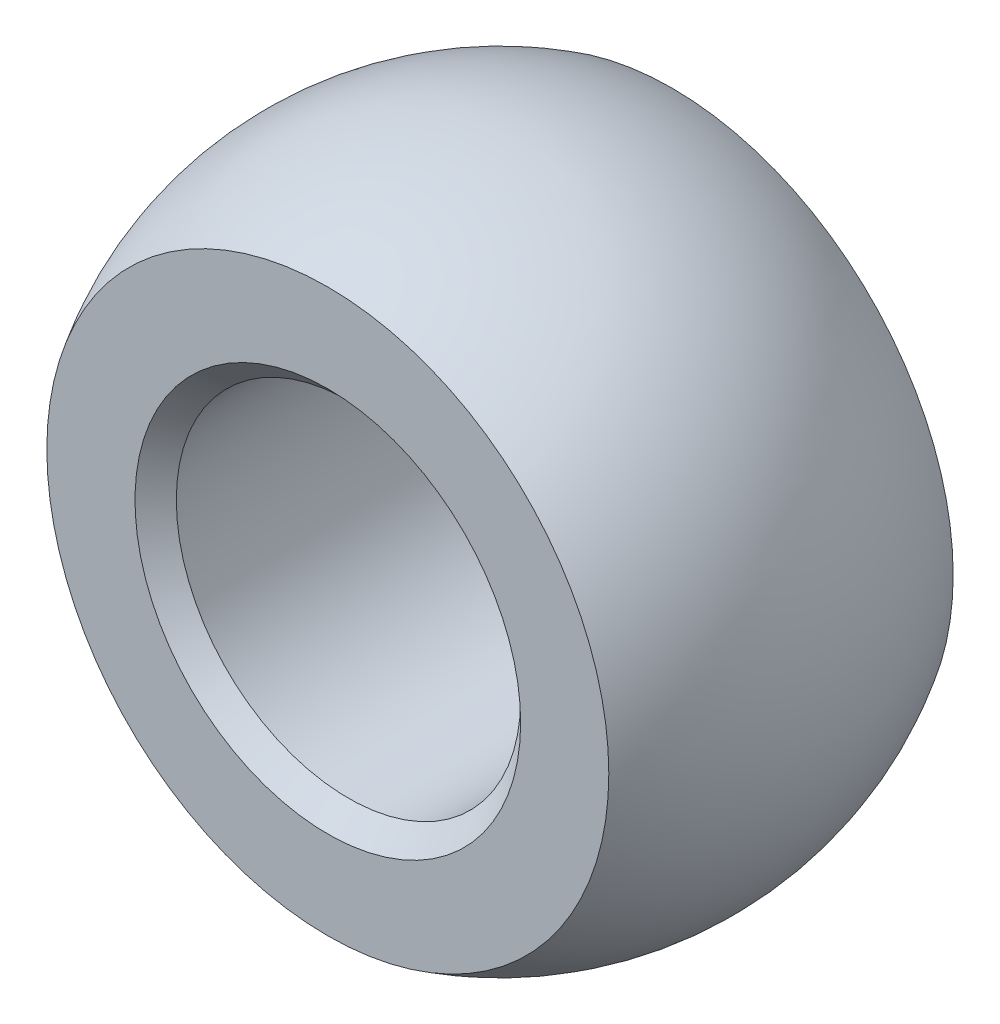
ISO-10303-21;
HEADER;
FILE_DESCRIPTION(('STEP AP214'),'2;1');
FILE_NAME('part.step','',(''),(''),'','','');
FILE_SCHEMA(('AUTOMOTIVE_DESIGN { 1 0 10303 214 1 1 1 1 }'));
ENDSEC;
DATA;
#1=APPLICATION_CONTEXT('core data for automotive mechanical design processes');
#2=APPLICATION_PROTOCOL_DEFINITION('international standard','automotive_design',2000,#1);
#3=PRODUCT_CONTEXT('',#1,'mechanical');
#4=PRODUCT('Part','Part','',(#3));
#5=PRODUCT_RELATED_PRODUCT_CATEGORY('part','',(#4));
#6=PRODUCT_DEFINITION_FORMATION('','',#4);
#7=PRODUCT_DEFINITION_CONTEXT('part definition',#1,'design');
#8=PRODUCT_DEFINITION('design','',#6,#7);
#9=PRODUCT_DEFINITION_SHAPE('','',#8);
#10=(LENGTH_UNIT() NAMED_UNIT(*) SI_UNIT(.MILLI.,.METRE.));
#11=(NAMED_UNIT(*) PLANE_ANGLE_UNIT() SI_UNIT($,.RADIAN.));
#12=(NAMED_UNIT(*) SI_UNIT($,.STERADIAN.) SOLID_ANGLE_UNIT());
#13=UNCERTAINTY_MEASURE_WITH_UNIT(LENGTH_MEASURE(1.E-05),#10,'distance_accuracy_value','');
#14=(GEOMETRIC_REPRESENTATION_CONTEXT(3) GLOBAL_UNCERTAINTY_ASSIGNED_CONTEXT((#13)) GLOBAL_UNIT_ASSIGNED_CONTEXT((#10,
#11,#12)) REPRESENTATION_CONTEXT('',''));
#15=CARTESIAN_POINT('',(0.,0.,0.));
#16=DIRECTION('',(0.,0.,1.));
#17=DIRECTION('',(1.,0.,0.));
#18=AXIS2_PLACEMENT_3D('',#15,#16,#17);
#19=CARTESIAN_POINT('',(-2.33155667448472E-05,0.,0.));
#20=DIRECTION('',(0.,1.,0.));
#21=DIRECTION('',(1.,0.,0.));
#22=AXIS2_PLACEMENT_3D('',#19,#20,#21);
#23=SPHERICAL_SURFACE('',#22,6.07695);
#24=CARTESIAN_POINT('',(-2.33155667448472E-05,0.,0.));
#25=DIRECTION('',(0.,0.,1.));
#26=DIRECTION('',(0.,-1.,0.));
#27=AXIS2_PLACEMENT_3D('',#24,#25,#26);
#28=SPHERICAL_SURFACE('',#27,6.07695);
#29=CARTESIAN_POINT('',(-2.33155667448472E-05,0.,-3.175));
#30=DIRECTION('',(0.,0.,1.));
#31=DIRECTION('',(0.,-1.,0.));
#32=AXIS2_PLACEMENT_3D('',#29,#30,#31);
#33=CIRCLE('',#32,5.18157276340881);
#34=CARTESIAN_POINT('',(-2.33155667448472E-05,-5.18157276340881,-3.175));
#35=VERTEX_POINT('',#34);
#36=EDGE_CURVE('E56',#35,#35,#33,.T.);
#37=ORIENTED_EDGE('',*,*,#36,.T.);
#38=EDGE_LOOP('',(#37));
#39=FACE_BOUND('',#38,.T.);
#40=CARTESIAN_POINT('',(-2.33155667448472E-05,0.,3.175));
#41=DIRECTION('',(0.,0.,-1.));
#42=DIRECTION('',(0.,1.,0.));
#43=AXIS2_PLACEMENT_3D('',#40,#41,#42);
#44=CIRCLE('',#43,5.18157276340881);
#45=CARTESIAN_POINT('',(-2.33155667448472E-05,5.18157276340881,3.175));
#46=VERTEX_POINT('',#45);
#47=EDGE_CURVE('E55',#46,#46,#44,.T.);
#48=ORIENTED_EDGE('',*,*,#47,.T.);
#49=EDGE_LOOP('',(#48));
#50=FACE_BOUND('',#49,.T.);
#51=ADVANCED_FACE('F35',(#39,#50),#28,.T.);
#52=CARTESIAN_POINT('',(-6.07697331556674,25.4,3.17500000000001));
#53=DIRECTION('',(0.,0.,-1.));
#54=DIRECTION('',(0.,1.,0.));
#55=AXIS2_PLACEMENT_3D('',#52,#53,#54);
#56=PLANE('',#55);
#57=CARTESIAN_POINT('',(-2.33155667448472E-05,0.,3.175));
#58=DIRECTION('',(0.,0.,-1.));
#59=DIRECTION('',(0.,1.,0.));
#60=AXIS2_PLACEMENT_3D('',#57,#58,#59);
#61=CIRCLE('',#60,3.556);
#62=CARTESIAN_POINT('',(-2.33155667448472E-05,3.556,3.175));
#63=VERTEX_POINT('',#62);
#64=EDGE_CURVE('E10',#63,#63,#61,.T.);
#65=ORIENTED_EDGE('',*,*,#64,.T.);
#66=EDGE_LOOP('',(#65));
#67=FACE_BOUND('',#66,.T.);
#68=ORIENTED_EDGE('',*,*,#47,.F.);
#69=EDGE_LOOP('',(#68));
#70=FACE_BOUND('',#69,.T.);
#71=ADVANCED_FACE('F63',(#67,#70),#56,.F.);
#72=CARTESIAN_POINT('',(-6.07697331556674,25.4,-3.17500000000001));
#73=DIRECTION('',(0.,0.,1.));
#74=DIRECTION('',(0.,-1.,0.));
#75=AXIS2_PLACEMENT_3D('',#72,#73,#74);
#76=PLANE('',#75);
#77=CARTESIAN_POINT('',(-2.33155667448472E-05,0.,-3.175));
#78=DIRECTION('',(0.,0.,1.));
#79=DIRECTION('',(0.,-1.,0.));
#80=AXIS2_PLACEMENT_3D('',#77,#78,#79);
#81=CIRCLE('',#80,3.556);
#82=CARTESIAN_POINT('',(-2.33155667448472E-05,-3.556,-3.175));
#83=VERTEX_POINT('',#82);
#84=EDGE_CURVE('E50',#83,#83,#81,.T.);
#85=ORIENTED_EDGE('',*,*,#84,.T.);
#86=EDGE_LOOP('',(#85));
#87=FACE_BOUND('',#86,.T.);
#88=ORIENTED_EDGE('',*,*,#36,.F.);
#89=EDGE_LOOP('',(#88));
#90=FACE_BOUND('',#89,.T.);
#91=ADVANCED_FACE('F65',(#87,#90),#76,.F.);
#92=CARTESIAN_POINT('',(-2.33155667448472E-05,0.,-3.175));
#93=DIRECTION('',(0.,0.,1.));
#94=DIRECTION('',(1.,0.,0.));
#95=AXIS2_PLACEMENT_3D('',#92,#93,#94);
#96=CYLINDRICAL_SURFACE('',#95,3.175);
#97=CARTESIAN_POINT('',(-2.33155667448472E-05,0.,-2.79400000000001));
#98=DIRECTION('',(0.,0.,1.));
#99=DIRECTION('',(1.,0.,0.));
#100=AXIS2_PLACEMENT_3D('',#97,#98,#99);
#101=CIRCLE('',#100,3.175);
#102=CARTESIAN_POINT('',(3.17497668443325,0.,-2.79400000000001));
#103=VERTEX_POINT('',#102);
#104=EDGE_CURVE('E42',#103,#103,#101,.F.);
#105=ORIENTED_EDGE('',*,*,#104,.T.);
#106=EDGE_LOOP('',(#105));
#107=FACE_BOUND('',#106,.T.);
#108=CARTESIAN_POINT('',(-2.33155667448472E-05,0.,2.794));
#109=DIRECTION('',(0.,0.,-1.));
#110=DIRECTION('',(-1.,0.,0.));
#111=AXIS2_PLACEMENT_3D('',#108,#109,#110);
#112=CIRCLE('',#111,3.175);
#113=CARTESIAN_POINT('',(-3.17502331556674,0.,2.794));
#114=VERTEX_POINT('',#113);
#115=EDGE_CURVE('E46',#114,#114,#112,.F.);
#116=ORIENTED_EDGE('',*,*,#115,.T.);
#117=EDGE_LOOP('',(#116));
#118=FACE_BOUND('',#117,.T.);
#119=ADVANCED_FACE('F71',(#107,#118),#96,.F.);
#120=CARTESIAN_POINT('',(-2.33155667448472E-05,0.,-3.175));
#121=DIRECTION('',(0.,0.,-1.));
#122=DIRECTION('',(-1.,0.,0.));
#123=AXIS2_PLACEMENT_3D('',#120,#121,#122);
#124=CONICAL_SURFACE('',#123,3.556,0.785398163397448);
#125=ORIENTED_EDGE('',*,*,#104,.F.);
#126=EDGE_LOOP('',(#125));
#127=FACE_BOUND('',#126,.T.);
#128=ORIENTED_EDGE('',*,*,#84,.F.);
#129=EDGE_LOOP('',(#128));
#130=FACE_BOUND('',#129,.T.);
#131=ADVANCED_FACE('F77',(#127,#130),#124,.F.);
#132=CARTESIAN_POINT('',(-2.33155667448472E-05,0.,2.794));
#133=DIRECTION('',(0.,0.,1.));
#134=DIRECTION('',(1.,0.,0.));
#135=AXIS2_PLACEMENT_3D('',#132,#133,#134);
#136=CONICAL_SURFACE('',#135,3.175,0.78539816339745);
#137=ORIENTED_EDGE('',*,*,#64,.F.);
#138=EDGE_LOOP('',(#137));
#139=FACE_BOUND('',#138,.T.);
#140=ORIENTED_EDGE('',*,*,#115,.F.);
#141=EDGE_LOOP('',(#140));
#142=FACE_BOUND('',#141,.T.);
#143=ADVANCED_FACE('F37',(#139,#142),#136,.F.);
#144=CLOSED_SHELL('',(#51,#71,#91,#119,#131,#143));
#145=MANIFOLD_SOLID_BREP('B2',#144);
#146=ADVANCED_BREP_SHAPE_REPRESENTATION('',(#18,#145),#14);
#147=SHAPE_DEFINITION_REPRESENTATION(#9,#146);
ENDSEC;
END-ISO-10303-21;
